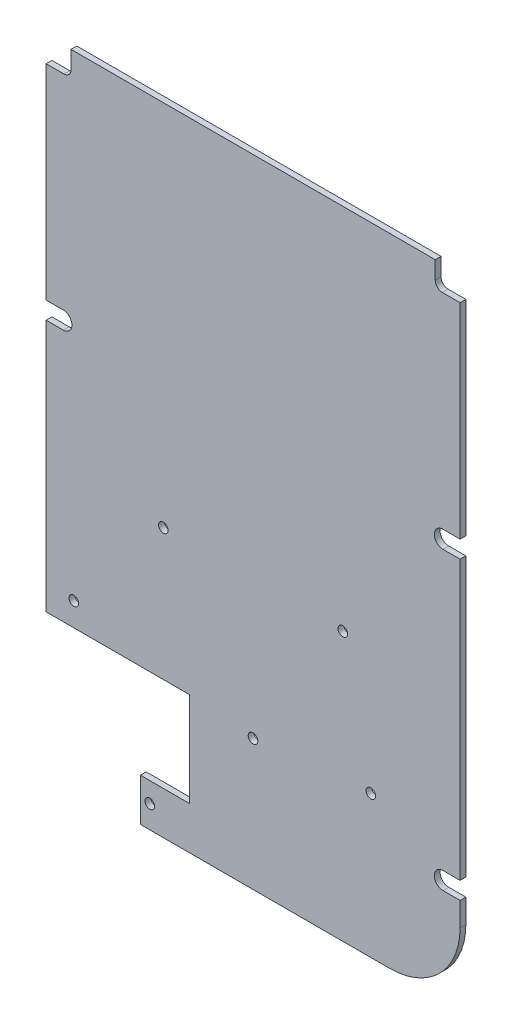
ISO-10303-21;
HEADER;
FILE_DESCRIPTION(('STEP AP214'),'2;1');
FILE_NAME('part.step','',(''),(''),'','','');
FILE_SCHEMA(('AUTOMOTIVE_DESIGN { 1 0 10303 214 1 1 1 1 }'));
ENDSEC;
DATA;
#1=APPLICATION_CONTEXT('core data for automotive mechanical design processes');
#2=APPLICATION_PROTOCOL_DEFINITION('international standard','automotive_design',2000,#1);
#3=PRODUCT_CONTEXT('',#1,'mechanical');
#4=PRODUCT('Part','Part','',(#3));
#5=PRODUCT_RELATED_PRODUCT_CATEGORY('part','',(#4));
#6=PRODUCT_DEFINITION_FORMATION('','',#4);
#7=PRODUCT_DEFINITION_CONTEXT('part definition',#1,'design');
#8=PRODUCT_DEFINITION('design','',#6,#7);
#9=PRODUCT_DEFINITION_SHAPE('','',#8);
#10=(LENGTH_UNIT() NAMED_UNIT(*) SI_UNIT(.MILLI.,.METRE.));
#11=(NAMED_UNIT(*) PLANE_ANGLE_UNIT() SI_UNIT($,.RADIAN.));
#12=(NAMED_UNIT(*) SI_UNIT($,.STERADIAN.) SOLID_ANGLE_UNIT());
#13=UNCERTAINTY_MEASURE_WITH_UNIT(LENGTH_MEASURE(1.E-05),#10,'distance_accuracy_value','');
#14=(GEOMETRIC_REPRESENTATION_CONTEXT(3) GLOBAL_UNCERTAINTY_ASSIGNED_CONTEXT((#13)) GLOBAL_UNIT_ASSIGNED_CONTEXT((#10,
#11,#12)) REPRESENTATION_CONTEXT('',''));
#15=CARTESIAN_POINT('',(0.,0.,0.));
#16=DIRECTION('',(0.,0.,1.));
#17=DIRECTION('',(1.,0.,0.));
#18=AXIS2_PLACEMENT_3D('',#15,#16,#17);
#19=CARTESIAN_POINT('',(-40.475,17.05,1.23));
#20=DIRECTION('',(0.,0.,1.));
#21=DIRECTION('',(1.,0.,0.));
#22=AXIS2_PLACEMENT_3D('',#19,#20,#21);
#23=PLANE('',#22);
#24=DIRECTION('',(0.,1.,0.));
#25=VECTOR('',#24,1.);
#26=CARTESIAN_POINT('',(-38.825,67.85,1.23));
#27=LINE('',#26,#25);
#28=CARTESIAN_POINT('',(-38.825,64.05,1.23));
#29=VERTEX_POINT('',#28);
#30=CARTESIAN_POINT('',(-38.825,67.85,1.23));
#31=VERTEX_POINT('',#30);
#32=EDGE_CURVE('E224',#29,#31,#27,.T.);
#33=ORIENTED_EDGE('',*,*,#32,.F.);
#34=CARTESIAN_POINT('',(-40.325,64.05,1.23));
#35=DIRECTION('',(0.,0.,1.));
#36=DIRECTION('',(1.,0.,0.));
#37=AXIS2_PLACEMENT_3D('',#34,#35,#36);
#38=CIRCLE('',#37,1.5);
#39=CARTESIAN_POINT('',(-40.325,62.55,1.23));
#40=VERTEX_POINT('',#39);
#41=EDGE_CURVE('E47',#29,#40,#38,.F.);
#42=ORIENTED_EDGE('',*,*,#41,.T.);
#43=DIRECTION('',(1.,0.,0.));
#44=VECTOR('',#43,1.);
#45=CARTESIAN_POINT('',(-44.125,62.55,1.23));
#46=LINE('',#45,#44);
#47=CARTESIAN_POINT('',(-44.125,62.55,1.23));
#48=VERTEX_POINT('',#47);
#49=EDGE_CURVE('E217',#48,#40,#46,.T.);
#50=ORIENTED_EDGE('',*,*,#49,.F.);
#51=DIRECTION('',(0.,-1.,0.));
#52=VECTOR('',#51,1.);
#53=CARTESIAN_POINT('',(-44.125,67.85,1.23));
#54=LINE('',#53,#52);
#55=CARTESIAN_POINT('',(-44.125,18.9,1.23));
#56=VERTEX_POINT('',#55);
#57=EDGE_CURVE('E227',#48,#56,#54,.T.);
#58=ORIENTED_EDGE('',*,*,#57,.T.);
#59=DIRECTION('',(1.,0.,0.));
#60=VECTOR('',#59,1.);
#61=CARTESIAN_POINT('',(-40.475,18.9,1.23));
#62=LINE('',#61,#60);
#63=CARTESIAN_POINT('',(-40.475,18.9,1.23));
#64=VERTEX_POINT('',#63);
#65=EDGE_CURVE('E237',#56,#64,#62,.T.);
#66=ORIENTED_EDGE('',*,*,#65,.T.);
#67=CARTESIAN_POINT('',(-40.475,17.05,1.23));
#68=DIRECTION('',(0.,0.,-1.));
#69=DIRECTION('',(1.,0.,0.));
#70=AXIS2_PLACEMENT_3D('',#67,#68,#69);
#71=CIRCLE('',#70,1.85);
#72=CARTESIAN_POINT('',(-40.475,15.2,1.23));
#73=VERTEX_POINT('',#72);
#74=EDGE_CURVE('E242',#64,#73,#71,.T.);
#75=ORIENTED_EDGE('',*,*,#74,.T.);
#76=DIRECTION('',(-1.,0.,0.));
#77=VECTOR('',#76,1.);
#78=CARTESIAN_POINT('',(-40.475,15.2,1.23));
#79=LINE('',#78,#77);
#80=CARTESIAN_POINT('',(-44.125,15.2,1.23));
#81=VERTEX_POINT('',#80);
#82=EDGE_CURVE('E253',#73,#81,#79,.T.);
#83=ORIENTED_EDGE('',*,*,#82,.T.);
#84=DIRECTION('',(0.,-1.,0.));
#85=VECTOR('',#84,1.);
#86=CARTESIAN_POINT('',(-44.125,15.2,1.23));
#87=LINE('',#86,#85);
#88=CARTESIAN_POINT('',(-44.125,-38.65,1.23));
#89=VERTEX_POINT('',#88);
#90=EDGE_CURVE('E256',#81,#89,#87,.T.);
#91=ORIENTED_EDGE('',*,*,#90,.T.);
#92=DIRECTION('',(1.,0.,0.));
#93=VECTOR('',#92,1.);
#94=CARTESIAN_POINT('',(-44.125,-38.65,1.23));
#95=LINE('',#94,#93);
#96=CARTESIAN_POINT('',(-13.525,-38.65,1.23));
#97=VERTEX_POINT('',#96);
#98=EDGE_CURVE('E259',#89,#97,#95,.T.);
#99=ORIENTED_EDGE('',*,*,#98,.T.);
#100=DIRECTION('',(0.,-1.,0.));
#101=VECTOR('',#100,1.);
#102=CARTESIAN_POINT('',(-13.525,-38.65,1.23));
#103=LINE('',#102,#101);
#104=CARTESIAN_POINT('',(-13.525,-58.75,1.23));
#105=VERTEX_POINT('',#104);
#106=EDGE_CURVE('E262',#97,#105,#103,.T.);
#107=ORIENTED_EDGE('',*,*,#106,.T.);
#108=DIRECTION('',(-1.,0.,0.));
#109=VECTOR('',#108,1.);
#110=CARTESIAN_POINT('',(-24.025,-58.75,1.23));
#111=LINE('',#110,#109);
#112=CARTESIAN_POINT('',(-24.025,-58.75,1.23));
#113=VERTEX_POINT('',#112);
#114=EDGE_CURVE('E265',#105,#113,#111,.T.);
#115=ORIENTED_EDGE('',*,*,#114,.T.);
#116=DIRECTION('',(0.,-1.,0.));
#117=VECTOR('',#116,1.);
#118=CARTESIAN_POINT('',(-24.025,-58.75,1.23));
#119=LINE('',#118,#117);
#120=CARTESIAN_POINT('',(-24.025,-67.85,1.23));
#121=VERTEX_POINT('',#120);
#122=EDGE_CURVE('E268',#113,#121,#119,.T.);
#123=ORIENTED_EDGE('',*,*,#122,.T.);
#124=DIRECTION('',(1.,0.,0.));
#125=VECTOR('',#124,1.);
#126=CARTESIAN_POINT('',(-24.025,-67.85,1.23));
#127=LINE('',#126,#125);
#128=CARTESIAN_POINT('',(29.1249999999999,-67.85,1.23));
#129=VERTEX_POINT('',#128);
#130=EDGE_CURVE('E271',#121,#129,#127,.T.);
#131=ORIENTED_EDGE('',*,*,#130,.T.);
#132=CARTESIAN_POINT('',(29.125,-52.85,1.23));
#133=DIRECTION('',(0.,0.,1.));
#134=DIRECTION('',(1.,0.,0.));
#135=AXIS2_PLACEMENT_3D('',#132,#133,#134);
#136=CIRCLE('',#135,15.);
#137=CARTESIAN_POINT('',(44.125,-52.85,1.23));
#138=VERTEX_POINT('',#137);
#139=EDGE_CURVE('E274',#129,#138,#136,.T.);
#140=ORIENTED_EDGE('',*,*,#139,.T.);
#141=DIRECTION('',(0.,1.,0.));
#142=VECTOR('',#141,1.);
#143=CARTESIAN_POINT('',(44.125,-47.8,1.23));
#144=LINE('',#143,#142);
#145=CARTESIAN_POINT('',(44.125,-47.8,1.23));
#146=VERTEX_POINT('',#145);
#147=EDGE_CURVE('E277',#138,#146,#144,.T.);
#148=ORIENTED_EDGE('',*,*,#147,.T.);
#149=DIRECTION('',(-1.,0.,0.));
#150=VECTOR('',#149,1.);
#151=CARTESIAN_POINT('',(40.475,-47.8,1.23));
#152=LINE('',#151,#150);
#153=CARTESIAN_POINT('',(40.475,-47.8,1.23));
#154=VERTEX_POINT('',#153);
#155=EDGE_CURVE('E280',#146,#154,#152,.T.);
#156=ORIENTED_EDGE('',*,*,#155,.T.);
#157=CARTESIAN_POINT('',(40.475,-45.95,1.23));
#158=DIRECTION('',(0.,0.,-1.));
#159=DIRECTION('',(1.,0.,0.));
#160=AXIS2_PLACEMENT_3D('',#157,#158,#159);
#161=CIRCLE('',#160,1.84999999999999);
#162=CARTESIAN_POINT('',(40.475,-44.1,1.23));
#163=VERTEX_POINT('',#162);
#164=EDGE_CURVE('E283',#154,#163,#161,.T.);
#165=ORIENTED_EDGE('',*,*,#164,.T.);
#166=DIRECTION('',(1.,0.,0.));
#167=VECTOR('',#166,1.);
#168=CARTESIAN_POINT('',(40.475,-44.1,1.23));
#169=LINE('',#168,#167);
#170=CARTESIAN_POINT('',(44.125,-44.1,1.23));
#171=VERTEX_POINT('',#170);
#172=EDGE_CURVE('E286',#163,#171,#169,.T.);
#173=ORIENTED_EDGE('',*,*,#172,.T.);
#174=DIRECTION('',(0.,1.,0.));
#175=VECTOR('',#174,1.);
#176=CARTESIAN_POINT('',(44.125,15.2,1.23));
#177=LINE('',#176,#175);
#178=CARTESIAN_POINT('',(44.125,15.2,1.23));
#179=VERTEX_POINT('',#178);
#180=EDGE_CURVE('E289',#171,#179,#177,.T.);
#181=ORIENTED_EDGE('',*,*,#180,.T.);
#182=DIRECTION('',(-1.,0.,0.));
#183=VECTOR('',#182,1.);
#184=CARTESIAN_POINT('',(40.475,15.2,1.23));
#185=LINE('',#184,#183);
#186=CARTESIAN_POINT('',(40.475,15.2000000000002,1.23));
#187=VERTEX_POINT('',#186);
#188=EDGE_CURVE('E292',#179,#187,#185,.T.);
#189=ORIENTED_EDGE('',*,*,#188,.T.);
#190=CARTESIAN_POINT('',(40.475,17.0500000000002,1.23));
#191=DIRECTION('',(0.,0.,-1.));
#192=DIRECTION('',(1.,0.,0.));
#193=AXIS2_PLACEMENT_3D('',#190,#191,#192);
#194=CIRCLE('',#193,1.85);
#195=CARTESIAN_POINT('',(40.475,18.9,1.23));
#196=VERTEX_POINT('',#195);
#197=EDGE_CURVE('E295',#187,#196,#194,.T.);
#198=ORIENTED_EDGE('',*,*,#197,.T.);
#199=DIRECTION('',(1.,0.,0.));
#200=VECTOR('',#199,1.);
#201=CARTESIAN_POINT('',(40.475,18.9,1.23));
#202=LINE('',#201,#200);
#203=CARTESIAN_POINT('',(44.125,18.9,1.23));
#204=VERTEX_POINT('',#203);
#205=EDGE_CURVE('E298',#196,#204,#202,.T.);
#206=ORIENTED_EDGE('',*,*,#205,.T.);
#207=DIRECTION('',(0.,1.,0.));
#208=VECTOR('',#207,1.);
#209=CARTESIAN_POINT('',(44.125,67.85,1.23));
#210=LINE('',#209,#208);
#211=CARTESIAN_POINT('',(44.125,62.55,1.23));
#212=VERTEX_POINT('',#211);
#213=EDGE_CURVE('E301',#204,#212,#210,.T.);
#214=ORIENTED_EDGE('',*,*,#213,.T.);
#215=DIRECTION('',(1.,0.,0.));
#216=VECTOR('',#215,1.);
#217=CARTESIAN_POINT('',(44.125,62.55,1.23));
#218=LINE('',#217,#216);
#219=CARTESIAN_POINT('',(40.325,62.55,1.23));
#220=VERTEX_POINT('',#219);
#221=EDGE_CURVE('E496',#220,#212,#218,.T.);
#222=ORIENTED_EDGE('',*,*,#221,.F.);
#223=CARTESIAN_POINT('',(40.325,64.05,1.23));
#224=DIRECTION('',(0.,0.,1.));
#225=DIRECTION('',(1.,0.,0.));
#226=AXIS2_PLACEMENT_3D('',#223,#224,#225);
#227=CIRCLE('',#226,1.5);
#228=CARTESIAN_POINT('',(38.825,64.05,1.23));
#229=VERTEX_POINT('',#228);
#230=EDGE_CURVE('E465',#220,#229,#227,.F.);
#231=ORIENTED_EDGE('',*,*,#230,.T.);
#232=DIRECTION('',(0.,-1.,0.));
#233=VECTOR('',#232,1.);
#234=CARTESIAN_POINT('',(38.825,67.85,1.23));
#235=LINE('',#234,#233);
#236=CARTESIAN_POINT('',(38.825,67.85,1.23));
#237=VERTEX_POINT('',#236);
#238=EDGE_CURVE('E494',#237,#229,#235,.T.);
#239=ORIENTED_EDGE('',*,*,#238,.F.);
#240=DIRECTION('',(-1.,0.,0.));
#241=VECTOR('',#240,1.);
#242=CARTESIAN_POINT('',(-44.125,67.85,1.23));
#243=LINE('',#242,#241);
#244=EDGE_CURVE('E305',#237,#31,#243,.T.);
#245=ORIENTED_EDGE('',*,*,#244,.T.);
#246=EDGE_LOOP('',(#33,#42,#50,#58,#66,#75,#83,#91,#99,#107,#115,#123,#131,#140,#148,#156,#165,
#173,#181,#189,#198,#206,#214,#222,#231,#239,#245));
#247=FACE_BOUND('',#246,.T.);
#248=CARTESIAN_POINT('',(25.075,-37.55,1.23));
#249=DIRECTION('',(0.,0.,1.));
#250=DIRECTION('',(1.,0.,0.));
#251=AXIS2_PLACEMENT_3D('',#248,#249,#250);
#252=CIRCLE('',#251,1.02499999999999);
#253=CARTESIAN_POINT('',(26.1,-37.55,1.23));
#254=VERTEX_POINT('',#253);
#255=EDGE_CURVE('E522',#254,#254,#252,.T.);
#256=ORIENTED_EDGE('',*,*,#255,.F.);
#257=EDGE_LOOP('',(#256));
#258=FACE_BOUND('',#257,.T.);
#259=CARTESIAN_POINT('',(-0.0249999999999971,-39.95,1.23));
#260=DIRECTION('',(0.,0.,1.));
#261=DIRECTION('',(1.,0.,0.));
#262=AXIS2_PLACEMENT_3D('',#259,#260,#261);
#263=CIRCLE('',#262,1.025);
#264=CARTESIAN_POINT('',(1.,-39.95,1.23));
#265=VERTEX_POINT('',#264);
#266=EDGE_CURVE('E538',#265,#265,#263,.T.);
#267=ORIENTED_EDGE('',*,*,#266,.F.);
#268=EDGE_LOOP('',(#267));
#269=FACE_BOUND('',#268,.T.);
#270=CARTESIAN_POINT('',(-22.025,-63.,1.23));
#271=DIRECTION('',(0.,0.,1.));
#272=DIRECTION('',(1.,0.,0.));
#273=AXIS2_PLACEMENT_3D('',#270,#271,#272);
#274=CIRCLE('',#273,1.025);
#275=CARTESIAN_POINT('',(-21.,-63.,1.23));
#276=VERTEX_POINT('',#275);
#277=EDGE_CURVE('E314',#276,#276,#274,.T.);
#278=ORIENTED_EDGE('',*,*,#277,.F.);
#279=EDGE_LOOP('',(#278));
#280=FACE_BOUND('',#279,.T.);
#281=CARTESIAN_POINT('',(-19.125,-10.6,1.23));
#282=DIRECTION('',(0.,0.,1.));
#283=DIRECTION('',(1.,0.,0.));
#284=AXIS2_PLACEMENT_3D('',#281,#282,#283);
#285=CIRCLE('',#284,1.025);
#286=CARTESIAN_POINT('',(-18.1,-10.6,1.23));
#287=VERTEX_POINT('',#286);
#288=EDGE_CURVE('E546',#287,#287,#285,.T.);
#289=ORIENTED_EDGE('',*,*,#288,.F.);
#290=EDGE_LOOP('',(#289));
#291=FACE_BOUND('',#290,.T.);
#292=CARTESIAN_POINT('',(-38.225,-33.65,1.23));
#293=DIRECTION('',(0.,0.,1.));
#294=DIRECTION('',(1.,0.,0.));
#295=AXIS2_PLACEMENT_3D('',#292,#293,#294);
#296=CIRCLE('',#295,1.025);
#297=CARTESIAN_POINT('',(-37.2,-33.65,1.23));
#298=VERTEX_POINT('',#297);
#299=EDGE_CURVE('E530',#298,#298,#296,.T.);
#300=ORIENTED_EDGE('',*,*,#299,.F.);
#301=EDGE_LOOP('',(#300));
#302=FACE_BOUND('',#301,.T.);
#303=CARTESIAN_POINT('',(19.125,-10.6,1.23));
#304=DIRECTION('',(0.,0.,1.));
#305=DIRECTION('',(1.,0.,0.));
#306=AXIS2_PLACEMENT_3D('',#303,#304,#305);
#307=CIRCLE('',#306,1.025);
#308=CARTESIAN_POINT('',(20.15,-10.6,1.23));
#309=VERTEX_POINT('',#308);
#310=EDGE_CURVE('E514',#309,#309,#307,.T.);
#311=ORIENTED_EDGE('',*,*,#310,.F.);
#312=EDGE_LOOP('',(#311));
#313=FACE_BOUND('',#312,.T.);
#314=ADVANCED_FACE('F38',(#247,#258,#269,#280,#291,#302,#313),#23,.T.);
#315=CARTESIAN_POINT('',(-40.475,17.05,0.));
#316=DIRECTION('',(0.,0.,1.));
#317=DIRECTION('',(1.,0.,0.));
#318=AXIS2_PLACEMENT_3D('',#315,#316,#317);
#319=PLANE('',#318);
#320=DIRECTION('',(1.,0.,0.));
#321=VECTOR('',#320,1.);
#322=CARTESIAN_POINT('',(-40.475,62.55,0.));
#323=LINE('',#322,#321);
#324=CARTESIAN_POINT('',(-44.125,62.55,0.));
#325=VERTEX_POINT('',#324);
#326=CARTESIAN_POINT('',(-40.325,62.55,0.));
#327=VERTEX_POINT('',#326);
#328=EDGE_CURVE('E218',#325,#327,#323,.T.);
#329=ORIENTED_EDGE('',*,*,#328,.T.);
#330=CARTESIAN_POINT('',(-40.325,64.05,0.));
#331=DIRECTION('',(0.,0.,1.));
#332=DIRECTION('',(1.,0.,0.));
#333=AXIS2_PLACEMENT_3D('',#330,#331,#332);
#334=CIRCLE('',#333,1.5);
#335=CARTESIAN_POINT('',(-38.825,64.05,0.));
#336=VERTEX_POINT('',#335);
#337=EDGE_CURVE('E11',#327,#336,#334,.T.);
#338=ORIENTED_EDGE('',*,*,#337,.T.);
#339=DIRECTION('',(0.,1.,0.));
#340=VECTOR('',#339,1.);
#341=CARTESIAN_POINT('',(-38.825,17.05,0.));
#342=LINE('',#341,#340);
#343=CARTESIAN_POINT('',(-38.825,67.85,0.));
#344=VERTEX_POINT('',#343);
#345=EDGE_CURVE('E489',#336,#344,#342,.T.);
#346=ORIENTED_EDGE('',*,*,#345,.T.);
#347=DIRECTION('',(-1.,0.,0.));
#348=VECTOR('',#347,1.);
#349=CARTESIAN_POINT('',(-44.125,67.85,0.));
#350=LINE('',#349,#348);
#351=CARTESIAN_POINT('',(38.825,67.85,0.));
#352=VERTEX_POINT('',#351);
#353=EDGE_CURVE('E238',#352,#344,#350,.T.);
#354=ORIENTED_EDGE('',*,*,#353,.F.);
#355=DIRECTION('',(0.,-1.,0.));
#356=VECTOR('',#355,1.);
#357=CARTESIAN_POINT('',(38.825,17.05,0.));
#358=LINE('',#357,#356);
#359=CARTESIAN_POINT('',(38.825,64.05,0.));
#360=VERTEX_POINT('',#359);
#361=EDGE_CURVE('E223',#352,#360,#358,.T.);
#362=ORIENTED_EDGE('',*,*,#361,.T.);
#363=CARTESIAN_POINT('',(40.325,64.05,0.));
#364=DIRECTION('',(0.,0.,1.));
#365=DIRECTION('',(1.,0.,0.));
#366=AXIS2_PLACEMENT_3D('',#363,#364,#365);
#367=CIRCLE('',#366,1.5);
#368=CARTESIAN_POINT('',(40.325,62.55,0.));
#369=VERTEX_POINT('',#368);
#370=EDGE_CURVE('E468',#360,#369,#367,.T.);
#371=ORIENTED_EDGE('',*,*,#370,.T.);
#372=DIRECTION('',(1.,0.,0.));
#373=VECTOR('',#372,1.);
#374=CARTESIAN_POINT('',(-40.475,62.55,0.));
#375=LINE('',#374,#373);
#376=CARTESIAN_POINT('',(44.125,62.55,0.));
#377=VERTEX_POINT('',#376);
#378=EDGE_CURVE('E478',#369,#377,#375,.T.);
#379=ORIENTED_EDGE('',*,*,#378,.T.);
#380=DIRECTION('',(0.,1.,0.));
#381=VECTOR('',#380,1.);
#382=CARTESIAN_POINT('',(44.125,67.85,0.));
#383=LINE('',#382,#381);
#384=CARTESIAN_POINT('',(44.125,18.9,0.));
#385=VERTEX_POINT('',#384);
#386=EDGE_CURVE('E245',#385,#377,#383,.T.);
#387=ORIENTED_EDGE('',*,*,#386,.F.);
#388=DIRECTION('',(1.,0.,0.));
#389=VECTOR('',#388,1.);
#390=CARTESIAN_POINT('',(40.475,18.9,0.));
#391=LINE('',#390,#389);
#392=CARTESIAN_POINT('',(40.475,18.9,0.));
#393=VERTEX_POINT('',#392);
#394=EDGE_CURVE('E365',#393,#385,#391,.T.);
#395=ORIENTED_EDGE('',*,*,#394,.F.);
#396=CARTESIAN_POINT('',(40.475,17.0500000000002,0.));
#397=DIRECTION('',(0.,0.,-1.));
#398=DIRECTION('',(1.,0.,0.));
#399=AXIS2_PLACEMENT_3D('',#396,#397,#398);
#400=CIRCLE('',#399,1.85);
#401=CARTESIAN_POINT('',(40.475,15.2000000000002,0.));
#402=VERTEX_POINT('',#401);
#403=EDGE_CURVE('E362',#402,#393,#400,.T.);
#404=ORIENTED_EDGE('',*,*,#403,.F.);
#405=DIRECTION('',(-1.,0.,0.));
#406=VECTOR('',#405,1.);
#407=CARTESIAN_POINT('',(40.475,15.2,0.));
#408=LINE('',#407,#406);
#409=CARTESIAN_POINT('',(44.125,15.2,0.));
#410=VERTEX_POINT('',#409);
#411=EDGE_CURVE('E359',#410,#402,#408,.T.);
#412=ORIENTED_EDGE('',*,*,#411,.F.);
#413=DIRECTION('',(0.,1.,0.));
#414=VECTOR('',#413,1.);
#415=CARTESIAN_POINT('',(44.125,15.2,0.));
#416=LINE('',#415,#414);
#417=CARTESIAN_POINT('',(44.125,-44.1,0.));
#418=VERTEX_POINT('',#417);
#419=EDGE_CURVE('E356',#418,#410,#416,.T.);
#420=ORIENTED_EDGE('',*,*,#419,.F.);
#421=DIRECTION('',(1.,0.,0.));
#422=VECTOR('',#421,1.);
#423=CARTESIAN_POINT('',(40.475,-44.1,0.));
#424=LINE('',#423,#422);
#425=CARTESIAN_POINT('',(40.475,-44.1,0.));
#426=VERTEX_POINT('',#425);
#427=EDGE_CURVE('E353',#426,#418,#424,.T.);
#428=ORIENTED_EDGE('',*,*,#427,.F.);
#429=CARTESIAN_POINT('',(40.475,-45.95,0.));
#430=DIRECTION('',(0.,0.,-1.));
#431=DIRECTION('',(1.,0.,0.));
#432=AXIS2_PLACEMENT_3D('',#429,#430,#431);
#433=CIRCLE('',#432,1.84999999999999);
#434=CARTESIAN_POINT('',(40.475,-47.8,0.));
#435=VERTEX_POINT('',#434);
#436=EDGE_CURVE('E350',#435,#426,#433,.T.);
#437=ORIENTED_EDGE('',*,*,#436,.F.);
#438=DIRECTION('',(-1.,0.,0.));
#439=VECTOR('',#438,1.);
#440=CARTESIAN_POINT('',(40.475,-47.8,0.));
#441=LINE('',#440,#439);
#442=CARTESIAN_POINT('',(44.125,-47.8,0.));
#443=VERTEX_POINT('',#442);
#444=EDGE_CURVE('E347',#443,#435,#441,.T.);
#445=ORIENTED_EDGE('',*,*,#444,.F.);
#446=DIRECTION('',(0.,1.,0.));
#447=VECTOR('',#446,1.);
#448=CARTESIAN_POINT('',(44.125,-47.8,0.));
#449=LINE('',#448,#447);
#450=CARTESIAN_POINT('',(44.125,-52.85,0.));
#451=VERTEX_POINT('',#450);
#452=EDGE_CURVE('E344',#451,#443,#449,.T.);
#453=ORIENTED_EDGE('',*,*,#452,.F.);
#454=CARTESIAN_POINT('',(29.125,-52.85,0.));
#455=DIRECTION('',(0.,0.,1.));
#456=DIRECTION('',(1.,0.,0.));
#457=AXIS2_PLACEMENT_3D('',#454,#455,#456);
#458=CIRCLE('',#457,15.);
#459=CARTESIAN_POINT('',(29.1249999999999,-67.85,0.));
#460=VERTEX_POINT('',#459);
#461=EDGE_CURVE('E341',#460,#451,#458,.T.);
#462=ORIENTED_EDGE('',*,*,#461,.F.);
#463=DIRECTION('',(1.,0.,0.));
#464=VECTOR('',#463,1.);
#465=CARTESIAN_POINT('',(-24.025,-67.85,0.));
#466=LINE('',#465,#464);
#467=CARTESIAN_POINT('',(-24.025,-67.85,0.));
#468=VERTEX_POINT('',#467);
#469=EDGE_CURVE('E338',#468,#460,#466,.T.);
#470=ORIENTED_EDGE('',*,*,#469,.F.);
#471=DIRECTION('',(0.,-1.,0.));
#472=VECTOR('',#471,1.);
#473=CARTESIAN_POINT('',(-24.025,-58.75,0.));
#474=LINE('',#473,#472);
#475=CARTESIAN_POINT('',(-24.025,-58.75,0.));
#476=VERTEX_POINT('',#475);
#477=EDGE_CURVE('E335',#476,#468,#474,.T.);
#478=ORIENTED_EDGE('',*,*,#477,.F.);
#479=DIRECTION('',(-1.,0.,0.));
#480=VECTOR('',#479,1.);
#481=CARTESIAN_POINT('',(-24.025,-58.75,0.));
#482=LINE('',#481,#480);
#483=CARTESIAN_POINT('',(-13.525,-58.75,0.));
#484=VERTEX_POINT('',#483);
#485=EDGE_CURVE('E332',#484,#476,#482,.T.);
#486=ORIENTED_EDGE('',*,*,#485,.F.);
#487=DIRECTION('',(0.,-1.,0.));
#488=VECTOR('',#487,1.);
#489=CARTESIAN_POINT('',(-13.525,-38.65,0.));
#490=LINE('',#489,#488);
#491=CARTESIAN_POINT('',(-13.525,-38.65,0.));
#492=VERTEX_POINT('',#491);
#493=EDGE_CURVE('E329',#492,#484,#490,.T.);
#494=ORIENTED_EDGE('',*,*,#493,.F.);
#495=DIRECTION('',(1.,0.,0.));
#496=VECTOR('',#495,1.);
#497=CARTESIAN_POINT('',(-44.125,-38.65,0.));
#498=LINE('',#497,#496);
#499=CARTESIAN_POINT('',(-44.125,-38.65,0.));
#500=VERTEX_POINT('',#499);
#501=EDGE_CURVE('E326',#500,#492,#498,.T.);
#502=ORIENTED_EDGE('',*,*,#501,.F.);
#503=DIRECTION('',(0.,-1.,0.));
#504=VECTOR('',#503,1.);
#505=CARTESIAN_POINT('',(-44.125,15.2,0.));
#506=LINE('',#505,#504);
#507=CARTESIAN_POINT('',(-44.125,15.2,0.));
#508=VERTEX_POINT('',#507);
#509=EDGE_CURVE('E323',#508,#500,#506,.T.);
#510=ORIENTED_EDGE('',*,*,#509,.F.);
#511=DIRECTION('',(-1.,0.,0.));
#512=VECTOR('',#511,1.);
#513=CARTESIAN_POINT('',(-40.475,15.2,0.));
#514=LINE('',#513,#512);
#515=CARTESIAN_POINT('',(-40.475,15.2,0.));
#516=VERTEX_POINT('',#515);
#517=EDGE_CURVE('E320',#516,#508,#514,.T.);
#518=ORIENTED_EDGE('',*,*,#517,.F.);
#519=CARTESIAN_POINT('',(-40.475,17.05,0.));
#520=DIRECTION('',(0.,0.,-1.));
#521=DIRECTION('',(1.,0.,0.));
#522=AXIS2_PLACEMENT_3D('',#519,#520,#521);
#523=CIRCLE('',#522,1.85);
#524=CARTESIAN_POINT('',(-40.475,18.9,0.));
#525=VERTEX_POINT('',#524);
#526=EDGE_CURVE('E317',#525,#516,#523,.T.);
#527=ORIENTED_EDGE('',*,*,#526,.F.);
#528=DIRECTION('',(1.,0.,0.));
#529=VECTOR('',#528,1.);
#530=CARTESIAN_POINT('',(-40.475,18.9,0.));
#531=LINE('',#530,#529);
#532=CARTESIAN_POINT('',(-44.125,18.9,0.));
#533=VERTEX_POINT('',#532);
#534=EDGE_CURVE('E313',#533,#525,#531,.T.);
#535=ORIENTED_EDGE('',*,*,#534,.F.);
#536=DIRECTION('',(0.,-1.,0.));
#537=VECTOR('',#536,1.);
#538=CARTESIAN_POINT('',(-44.125,67.85,0.));
#539=LINE('',#538,#537);
#540=EDGE_CURVE('E310',#325,#533,#539,.T.);
#541=ORIENTED_EDGE('',*,*,#540,.F.);
#542=EDGE_LOOP('',(#329,#338,#346,#354,#362,#371,#379,#387,#395,#404,#412,#420,#428,#437,#445,
#453,#462,#470,#478,#486,#494,#502,#510,#518,#527,#535,#541));
#543=FACE_BOUND('',#542,.T.);
#544=CARTESIAN_POINT('',(-22.025,-63.,0.));
#545=DIRECTION('',(0.,0.,1.));
#546=DIRECTION('',(1.,0.,0.));
#547=AXIS2_PLACEMENT_3D('',#544,#545,#546);
#548=CIRCLE('',#547,1.025);
#549=CARTESIAN_POINT('',(-21.,-63.,0.));
#550=VERTEX_POINT('',#549);
#551=EDGE_CURVE('E248',#550,#550,#548,.T.);
#552=ORIENTED_EDGE('',*,*,#551,.T.);
#553=EDGE_LOOP('',(#552));
#554=FACE_BOUND('',#553,.T.);
#555=CARTESIAN_POINT('',(-19.125,-10.6,0.));
#556=DIRECTION('',(0.,0.,1.));
#557=DIRECTION('',(1.,0.,0.));
#558=AXIS2_PLACEMENT_3D('',#555,#556,#557);
#559=CIRCLE('',#558,1.025);
#560=CARTESIAN_POINT('',(-18.1,-10.6,0.));
#561=VERTEX_POINT('',#560);
#562=EDGE_CURVE('E542',#561,#561,#559,.T.);
#563=ORIENTED_EDGE('',*,*,#562,.T.);
#564=EDGE_LOOP('',(#563));
#565=FACE_BOUND('',#564,.T.);
#566=CARTESIAN_POINT('',(-0.0249999999999971,-39.95,0.));
#567=DIRECTION('',(0.,0.,1.));
#568=DIRECTION('',(1.,0.,0.));
#569=AXIS2_PLACEMENT_3D('',#566,#567,#568);
#570=CIRCLE('',#569,1.025);
#571=CARTESIAN_POINT('',(1.,-39.95,0.));
#572=VERTEX_POINT('',#571);
#573=EDGE_CURVE('E534',#572,#572,#570,.T.);
#574=ORIENTED_EDGE('',*,*,#573,.T.);
#575=EDGE_LOOP('',(#574));
#576=FACE_BOUND('',#575,.T.);
#577=CARTESIAN_POINT('',(-38.225,-33.65,0.));
#578=DIRECTION('',(0.,0.,1.));
#579=DIRECTION('',(1.,0.,0.));
#580=AXIS2_PLACEMENT_3D('',#577,#578,#579);
#581=CIRCLE('',#580,1.025);
#582=CARTESIAN_POINT('',(-37.2,-33.65,0.));
#583=VERTEX_POINT('',#582);
#584=EDGE_CURVE('E526',#583,#583,#581,.T.);
#585=ORIENTED_EDGE('',*,*,#584,.T.);
#586=EDGE_LOOP('',(#585));
#587=FACE_BOUND('',#586,.T.);
#588=CARTESIAN_POINT('',(25.075,-37.55,0.));
#589=DIRECTION('',(0.,0.,1.));
#590=DIRECTION('',(1.,0.,0.));
#591=AXIS2_PLACEMENT_3D('',#588,#589,#590);
#592=CIRCLE('',#591,1.02499999999999);
#593=CARTESIAN_POINT('',(26.1,-37.55,0.));
#594=VERTEX_POINT('',#593);
#595=EDGE_CURVE('E518',#594,#594,#592,.T.);
#596=ORIENTED_EDGE('',*,*,#595,.T.);
#597=EDGE_LOOP('',(#596));
#598=FACE_BOUND('',#597,.T.);
#599=CARTESIAN_POINT('',(19.125,-10.6,0.));
#600=DIRECTION('',(0.,0.,1.));
#601=DIRECTION('',(1.,0.,0.));
#602=AXIS2_PLACEMENT_3D('',#599,#600,#601);
#603=CIRCLE('',#602,1.025);
#604=CARTESIAN_POINT('',(20.15,-10.6,0.));
#605=VERTEX_POINT('',#604);
#606=EDGE_CURVE('E513',#605,#605,#603,.T.);
#607=ORIENTED_EDGE('',*,*,#606,.T.);
#608=EDGE_LOOP('',(#607));
#609=FACE_BOUND('',#608,.T.);
#610=ADVANCED_FACE('F475',(#543,#554,#565,#576,#587,#598,#609),#319,.F.);
#611=CARTESIAN_POINT('',(-44.125,67.85,1.23));
#612=DIRECTION('',(1.,0.,0.));
#613=DIRECTION('',(0.,0.,-1.));
#614=AXIS2_PLACEMENT_3D('',#611,#612,#613);
#615=PLANE('',#614);
#616=ORIENTED_EDGE('',*,*,#57,.F.);
#617=DIRECTION('',(0.,0.,1.));
#618=VECTOR('',#617,1.);
#619=CARTESIAN_POINT('',(-44.125,62.55,-8.77));
#620=LINE('',#619,#618);
#621=EDGE_CURVE('E215',#325,#48,#620,.T.);
#622=ORIENTED_EDGE('',*,*,#621,.F.);
#623=ORIENTED_EDGE('',*,*,#540,.T.);
#624=DIRECTION('',(0.,0.,-1.));
#625=VECTOR('',#624,1.);
#626=CARTESIAN_POINT('',(-44.125,18.9,1.23));
#627=LINE('',#626,#625);
#628=EDGE_CURVE('E235',#56,#533,#627,.T.);
#629=ORIENTED_EDGE('',*,*,#628,.F.);
#630=EDGE_LOOP('',(#616,#622,#623,#629));
#631=FACE_BOUND('',#630,.T.);
#632=ADVANCED_FACE('F233',(#631),#615,.F.);
#633=CARTESIAN_POINT('',(-40.475,18.9,1.23));
#634=DIRECTION('',(0.,1.,0.));
#635=DIRECTION('',(0.,0.,1.));
#636=AXIS2_PLACEMENT_3D('',#633,#634,#635);
#637=PLANE('',#636);
#638=ORIENTED_EDGE('',*,*,#534,.T.);
#639=DIRECTION('',(0.,0.,-1.));
#640=VECTOR('',#639,1.);
#641=CARTESIAN_POINT('',(-40.475,18.9,1.23));
#642=LINE('',#641,#640);
#643=EDGE_CURVE('E438',#64,#525,#642,.T.);
#644=ORIENTED_EDGE('',*,*,#643,.F.);
#645=ORIENTED_EDGE('',*,*,#65,.F.);
#646=ORIENTED_EDGE('',*,*,#628,.T.);
#647=EDGE_LOOP('',(#638,#644,#645,#646));
#648=FACE_BOUND('',#647,.T.);
#649=ADVANCED_FACE('F654',(#648),#637,.F.);
#650=CARTESIAN_POINT('',(-40.475,17.05,1.23));
#651=DIRECTION('',(0.,0.,-1.));
#652=DIRECTION('',(-1.,0.,0.));
#653=AXIS2_PLACEMENT_3D('',#650,#651,#652);
#654=CYLINDRICAL_SURFACE('',#653,1.85);
#655=ORIENTED_EDGE('',*,*,#526,.T.);
#656=DIRECTION('',(0.,0.,-1.));
#657=VECTOR('',#656,1.);
#658=CARTESIAN_POINT('',(-40.475,15.2,1.23));
#659=LINE('',#658,#657);
#660=EDGE_CURVE('E434',#73,#516,#659,.T.);
#661=ORIENTED_EDGE('',*,*,#660,.F.);
#662=ORIENTED_EDGE('',*,*,#74,.F.);
#663=ORIENTED_EDGE('',*,*,#643,.T.);
#664=EDGE_LOOP('',(#655,#661,#662,#663));
#665=FACE_BOUND('',#664,.T.);
#666=ADVANCED_FACE('F650',(#665),#654,.F.);
#667=CARTESIAN_POINT('',(-40.475,15.2,1.23));
#668=DIRECTION('',(0.,-1.,0.));
#669=DIRECTION('',(0.,0.,-1.));
#670=AXIS2_PLACEMENT_3D('',#667,#668,#669);
#671=PLANE('',#670);
#672=ORIENTED_EDGE('',*,*,#517,.T.);
#673=DIRECTION('',(0.,0.,-1.));
#674=VECTOR('',#673,1.);
#675=CARTESIAN_POINT('',(-44.125,15.2,1.23));
#676=LINE('',#675,#674);
#677=EDGE_CURVE('E430',#81,#508,#676,.T.);
#678=ORIENTED_EDGE('',*,*,#677,.F.);
#679=ORIENTED_EDGE('',*,*,#82,.F.);
#680=ORIENTED_EDGE('',*,*,#660,.T.);
#681=EDGE_LOOP('',(#672,#678,#679,#680));
#682=FACE_BOUND('',#681,.T.);
#683=ADVANCED_FACE('F646',(#682),#671,.F.);
#684=CARTESIAN_POINT('',(-44.125,15.2,1.23));
#685=DIRECTION('',(1.,0.,0.));
#686=DIRECTION('',(0.,1.,0.));
#687=AXIS2_PLACEMENT_3D('',#684,#685,#686);
#688=PLANE('',#687);
#689=ORIENTED_EDGE('',*,*,#509,.T.);
#690=DIRECTION('',(0.,0.,-1.));
#691=VECTOR('',#690,1.);
#692=CARTESIAN_POINT('',(-44.125,-38.65,1.23));
#693=LINE('',#692,#691);
#694=EDGE_CURVE('E426',#89,#500,#693,.T.);
#695=ORIENTED_EDGE('',*,*,#694,.F.);
#696=ORIENTED_EDGE('',*,*,#90,.F.);
#697=ORIENTED_EDGE('',*,*,#677,.T.);
#698=EDGE_LOOP('',(#689,#695,#696,#697));
#699=FACE_BOUND('',#698,.T.);
#700=ADVANCED_FACE('F642',(#699),#688,.F.);
#701=CARTESIAN_POINT('',(-44.125,-38.65,1.23));
#702=DIRECTION('',(0.,1.,0.));
#703=DIRECTION('',(0.,0.,1.));
#704=AXIS2_PLACEMENT_3D('',#701,#702,#703);
#705=PLANE('',#704);
#706=ORIENTED_EDGE('',*,*,#501,.T.);
#707=DIRECTION('',(0.,0.,-1.));
#708=VECTOR('',#707,1.);
#709=CARTESIAN_POINT('',(-13.525,-38.65,1.23));
#710=LINE('',#709,#708);
#711=EDGE_CURVE('E422',#97,#492,#710,.T.);
#712=ORIENTED_EDGE('',*,*,#711,.F.);
#713=ORIENTED_EDGE('',*,*,#98,.F.);
#714=ORIENTED_EDGE('',*,*,#694,.T.);
#715=EDGE_LOOP('',(#706,#712,#713,#714));
#716=FACE_BOUND('',#715,.T.);
#717=ADVANCED_FACE('F638',(#716),#705,.F.);
#718=CARTESIAN_POINT('',(-13.525,-38.65,1.23));
#719=DIRECTION('',(1.,0.,0.));
#720=DIRECTION('',(0.,1.,0.));
#721=AXIS2_PLACEMENT_3D('',#718,#719,#720);
#722=PLANE('',#721);
#723=ORIENTED_EDGE('',*,*,#493,.T.);
#724=DIRECTION('',(0.,0.,-1.));
#725=VECTOR('',#724,1.);
#726=CARTESIAN_POINT('',(-13.525,-58.75,1.23));
#727=LINE('',#726,#725);
#728=EDGE_CURVE('E418',#105,#484,#727,.T.);
#729=ORIENTED_EDGE('',*,*,#728,.F.);
#730=ORIENTED_EDGE('',*,*,#106,.F.);
#731=ORIENTED_EDGE('',*,*,#711,.T.);
#732=EDGE_LOOP('',(#723,#729,#730,#731));
#733=FACE_BOUND('',#732,.T.);
#734=ADVANCED_FACE('F634',(#733),#722,.F.);
#735=CARTESIAN_POINT('',(-24.025,-58.75,1.23));
#736=DIRECTION('',(0.,-1.,0.));
#737=DIRECTION('',(0.,0.,-1.));
#738=AXIS2_PLACEMENT_3D('',#735,#736,#737);
#739=PLANE('',#738);
#740=ORIENTED_EDGE('',*,*,#485,.T.);
#741=DIRECTION('',(0.,0.,-1.));
#742=VECTOR('',#741,1.);
#743=CARTESIAN_POINT('',(-24.025,-58.75,1.23));
#744=LINE('',#743,#742);
#745=EDGE_CURVE('E414',#113,#476,#744,.T.);
#746=ORIENTED_EDGE('',*,*,#745,.F.);
#747=ORIENTED_EDGE('',*,*,#114,.F.);
#748=ORIENTED_EDGE('',*,*,#728,.T.);
#749=EDGE_LOOP('',(#740,#746,#747,#748));
#750=FACE_BOUND('',#749,.T.);
#751=ADVANCED_FACE('F630',(#750),#739,.F.);
#752=CARTESIAN_POINT('',(-24.025,-58.75,1.23));
#753=DIRECTION('',(1.,0.,0.));
#754=DIRECTION('',(0.,0.,-1.));
#755=AXIS2_PLACEMENT_3D('',#752,#753,#754);
#756=PLANE('',#755);
#757=ORIENTED_EDGE('',*,*,#477,.T.);
#758=DIRECTION('',(0.,0.,-1.));
#759=VECTOR('',#758,1.);
#760=CARTESIAN_POINT('',(-24.025,-67.85,1.23));
#761=LINE('',#760,#759);
#762=EDGE_CURVE('E410',#121,#468,#761,.T.);
#763=ORIENTED_EDGE('',*,*,#762,.F.);
#764=ORIENTED_EDGE('',*,*,#122,.F.);
#765=ORIENTED_EDGE('',*,*,#745,.T.);
#766=EDGE_LOOP('',(#757,#763,#764,#765));
#767=FACE_BOUND('',#766,.T.);
#768=ADVANCED_FACE('F626',(#767),#756,.F.);
#769=CARTESIAN_POINT('',(-24.025,-67.85,1.23));
#770=DIRECTION('',(0.,1.,0.));
#771=DIRECTION('',(0.,0.,1.));
#772=AXIS2_PLACEMENT_3D('',#769,#770,#771);
#773=PLANE('',#772);
#774=ORIENTED_EDGE('',*,*,#469,.T.);
#775=DIRECTION('',(0.,0.,-1.));
#776=VECTOR('',#775,1.);
#777=CARTESIAN_POINT('',(29.1249999999999,-67.85,1.23));
#778=LINE('',#777,#776);
#779=EDGE_CURVE('E406',#129,#460,#778,.T.);
#780=ORIENTED_EDGE('',*,*,#779,.F.);
#781=ORIENTED_EDGE('',*,*,#130,.F.);
#782=ORIENTED_EDGE('',*,*,#762,.T.);
#783=EDGE_LOOP('',(#774,#780,#781,#782));
#784=FACE_BOUND('',#783,.T.);
#785=ADVANCED_FACE('F622',(#784),#773,.F.);
#786=CARTESIAN_POINT('',(29.125,-52.85,1.23));
#787=DIRECTION('',(0.,0.,-1.));
#788=DIRECTION('',(-1.,0.,0.));
#789=AXIS2_PLACEMENT_3D('',#786,#787,#788);
#790=CYLINDRICAL_SURFACE('',#789,15.);
#791=ORIENTED_EDGE('',*,*,#461,.T.);
#792=DIRECTION('',(0.,0.,-1.));
#793=VECTOR('',#792,1.);
#794=CARTESIAN_POINT('',(44.125,-52.85,1.23));
#795=LINE('',#794,#793);
#796=EDGE_CURVE('E402',#138,#451,#795,.T.);
#797=ORIENTED_EDGE('',*,*,#796,.F.);
#798=ORIENTED_EDGE('',*,*,#139,.F.);
#799=ORIENTED_EDGE('',*,*,#779,.T.);
#800=EDGE_LOOP('',(#791,#797,#798,#799));
#801=FACE_BOUND('',#800,.T.);
#802=ADVANCED_FACE('F618',(#801),#790,.T.);
#803=CARTESIAN_POINT('',(44.125,-47.8,1.23));
#804=DIRECTION('',(-1.,0.,0.));
#805=DIRECTION('',(0.,-1.,0.));
#806=AXIS2_PLACEMENT_3D('',#803,#804,#805);
#807=PLANE('',#806);
#808=ORIENTED_EDGE('',*,*,#452,.T.);
#809=DIRECTION('',(0.,0.,-1.));
#810=VECTOR('',#809,1.);
#811=CARTESIAN_POINT('',(44.125,-47.8,1.23));
#812=LINE('',#811,#810);
#813=EDGE_CURVE('E398',#146,#443,#812,.T.);
#814=ORIENTED_EDGE('',*,*,#813,.F.);
#815=ORIENTED_EDGE('',*,*,#147,.F.);
#816=ORIENTED_EDGE('',*,*,#796,.T.);
#817=EDGE_LOOP('',(#808,#814,#815,#816));
#818=FACE_BOUND('',#817,.T.);
#819=ADVANCED_FACE('F614',(#818),#807,.F.);
#820=CARTESIAN_POINT('',(40.475,-47.8,1.23));
#821=DIRECTION('',(0.,-1.,0.));
#822=DIRECTION('',(0.,0.,-1.));
#823=AXIS2_PLACEMENT_3D('',#820,#821,#822);
#824=PLANE('',#823);
#825=ORIENTED_EDGE('',*,*,#444,.T.);
#826=DIRECTION('',(0.,0.,-1.));
#827=VECTOR('',#826,1.);
#828=CARTESIAN_POINT('',(40.475,-47.8,1.23));
#829=LINE('',#828,#827);
#830=EDGE_CURVE('E394',#154,#435,#829,.T.);
#831=ORIENTED_EDGE('',*,*,#830,.F.);
#832=ORIENTED_EDGE('',*,*,#155,.F.);
#833=ORIENTED_EDGE('',*,*,#813,.T.);
#834=EDGE_LOOP('',(#825,#831,#832,#833));
#835=FACE_BOUND('',#834,.T.);
#836=ADVANCED_FACE('F610',(#835),#824,.F.);
#837=CARTESIAN_POINT('',(40.475,-45.95,1.23));
#838=DIRECTION('',(0.,0.,-1.));
#839=DIRECTION('',(-1.,0.,0.));
#840=AXIS2_PLACEMENT_3D('',#837,#838,#839);
#841=CYLINDRICAL_SURFACE('',#840,1.84999999999999);
#842=ORIENTED_EDGE('',*,*,#436,.T.);
#843=DIRECTION('',(0.,0.,-1.));
#844=VECTOR('',#843,1.);
#845=CARTESIAN_POINT('',(40.475,-44.1,1.23));
#846=LINE('',#845,#844);
#847=EDGE_CURVE('E390',#163,#426,#846,.T.);
#848=ORIENTED_EDGE('',*,*,#847,.F.);
#849=ORIENTED_EDGE('',*,*,#164,.F.);
#850=ORIENTED_EDGE('',*,*,#830,.T.);
#851=EDGE_LOOP('',(#842,#848,#849,#850));
#852=FACE_BOUND('',#851,.T.);
#853=ADVANCED_FACE('F606',(#852),#841,.F.);
#854=CARTESIAN_POINT('',(40.475,-44.1,1.23));
#855=DIRECTION('',(0.,1.,0.));
#856=DIRECTION('',(0.,0.,1.));
#857=AXIS2_PLACEMENT_3D('',#854,#855,#856);
#858=PLANE('',#857);
#859=ORIENTED_EDGE('',*,*,#427,.T.);
#860=DIRECTION('',(0.,0.,-1.));
#861=VECTOR('',#860,1.);
#862=CARTESIAN_POINT('',(44.125,-44.1,1.23));
#863=LINE('',#862,#861);
#864=EDGE_CURVE('E386',#171,#418,#863,.T.);
#865=ORIENTED_EDGE('',*,*,#864,.F.);
#866=ORIENTED_EDGE('',*,*,#172,.F.);
#867=ORIENTED_EDGE('',*,*,#847,.T.);
#868=EDGE_LOOP('',(#859,#865,#866,#867));
#869=FACE_BOUND('',#868,.T.);
#870=ADVANCED_FACE('F602',(#869),#858,.F.);
#871=CARTESIAN_POINT('',(44.125,15.2,1.23));
#872=DIRECTION('',(-1.,0.,0.));
#873=DIRECTION('',(0.,-1.,0.));
#874=AXIS2_PLACEMENT_3D('',#871,#872,#873);
#875=PLANE('',#874);
#876=ORIENTED_EDGE('',*,*,#419,.T.);
#877=DIRECTION('',(0.,0.,-1.));
#878=VECTOR('',#877,1.);
#879=CARTESIAN_POINT('',(44.125,15.2,1.23));
#880=LINE('',#879,#878);
#881=EDGE_CURVE('E382',#179,#410,#880,.T.);
#882=ORIENTED_EDGE('',*,*,#881,.F.);
#883=ORIENTED_EDGE('',*,*,#180,.F.);
#884=ORIENTED_EDGE('',*,*,#864,.T.);
#885=EDGE_LOOP('',(#876,#882,#883,#884));
#886=FACE_BOUND('',#885,.T.);
#887=ADVANCED_FACE('F598',(#886),#875,.F.);
#888=CARTESIAN_POINT('',(40.475,15.2,1.23));
#889=DIRECTION('',(0.,-1.,0.));
#890=DIRECTION('',(0.,0.,-1.));
#891=AXIS2_PLACEMENT_3D('',#888,#889,#890);
#892=PLANE('',#891);
#893=ORIENTED_EDGE('',*,*,#411,.T.);
#894=DIRECTION('',(0.,0.,-1.));
#895=VECTOR('',#894,1.);
#896=CARTESIAN_POINT('',(40.475,15.2000000000002,1.23));
#897=LINE('',#896,#895);
#898=EDGE_CURVE('E378',#187,#402,#897,.T.);
#899=ORIENTED_EDGE('',*,*,#898,.F.);
#900=ORIENTED_EDGE('',*,*,#188,.F.);
#901=ORIENTED_EDGE('',*,*,#881,.T.);
#902=EDGE_LOOP('',(#893,#899,#900,#901));
#903=FACE_BOUND('',#902,.T.);
#904=ADVANCED_FACE('F594',(#903),#892,.F.);
#905=CARTESIAN_POINT('',(40.475,17.0500000000002,1.23));
#906=DIRECTION('',(0.,0.,-1.));
#907=DIRECTION('',(-1.,0.,0.));
#908=AXIS2_PLACEMENT_3D('',#905,#906,#907);
#909=CYLINDRICAL_SURFACE('',#908,1.85);
#910=ORIENTED_EDGE('',*,*,#403,.T.);
#911=DIRECTION('',(0.,0.,-1.));
#912=VECTOR('',#911,1.);
#913=CARTESIAN_POINT('',(40.475,18.9,1.23));
#914=LINE('',#913,#912);
#915=EDGE_CURVE('E374',#196,#393,#914,.T.);
#916=ORIENTED_EDGE('',*,*,#915,.F.);
#917=ORIENTED_EDGE('',*,*,#197,.F.);
#918=ORIENTED_EDGE('',*,*,#898,.T.);
#919=EDGE_LOOP('',(#910,#916,#917,#918));
#920=FACE_BOUND('',#919,.T.);
#921=ADVANCED_FACE('F590',(#920),#909,.F.);
#922=CARTESIAN_POINT('',(40.475,18.9,1.23));
#923=DIRECTION('',(0.,1.,0.));
#924=DIRECTION('',(0.,0.,1.));
#925=AXIS2_PLACEMENT_3D('',#922,#923,#924);
#926=PLANE('',#925);
#927=ORIENTED_EDGE('',*,*,#394,.T.);
#928=DIRECTION('',(0.,0.,-1.));
#929=VECTOR('',#928,1.);
#930=CARTESIAN_POINT('',(44.125,18.9,1.23));
#931=LINE('',#930,#929);
#932=EDGE_CURVE('E309',#204,#385,#931,.T.);
#933=ORIENTED_EDGE('',*,*,#932,.F.);
#934=ORIENTED_EDGE('',*,*,#205,.F.);
#935=ORIENTED_EDGE('',*,*,#915,.T.);
#936=EDGE_LOOP('',(#927,#933,#934,#935));
#937=FACE_BOUND('',#936,.T.);
#938=ADVANCED_FACE('F586',(#937),#926,.F.);
#939=CARTESIAN_POINT('',(44.125,67.85,1.23));
#940=DIRECTION('',(-1.,0.,0.));
#941=DIRECTION('',(0.,-1.,0.));
#942=AXIS2_PLACEMENT_3D('',#939,#940,#941);
#943=PLANE('',#942);
#944=ORIENTED_EDGE('',*,*,#386,.T.);
#945=DIRECTION('',(0.,0.,1.));
#946=VECTOR('',#945,1.);
#947=CARTESIAN_POINT('',(44.125,62.55,-8.77));
#948=LINE('',#947,#946);
#949=EDGE_CURVE('E230',#377,#212,#948,.T.);
#950=ORIENTED_EDGE('',*,*,#949,.T.);
#951=ORIENTED_EDGE('',*,*,#213,.F.);
#952=ORIENTED_EDGE('',*,*,#932,.T.);
#953=EDGE_LOOP('',(#944,#950,#951,#952));
#954=FACE_BOUND('',#953,.T.);
#955=ADVANCED_FACE('F574',(#954),#943,.F.);
#956=CARTESIAN_POINT('',(-44.125,67.85,1.23));
#957=DIRECTION('',(0.,-1.,0.));
#958=DIRECTION('',(0.,0.,-1.));
#959=AXIS2_PLACEMENT_3D('',#956,#957,#958);
#960=PLANE('',#959);
#961=ORIENTED_EDGE('',*,*,#353,.T.);
#962=DIRECTION('',(0.,0.,1.));
#963=VECTOR('',#962,1.);
#964=CARTESIAN_POINT('',(-38.825,67.85,1.23));
#965=LINE('',#964,#963);
#966=EDGE_CURVE('E448',#344,#31,#965,.T.);
#967=ORIENTED_EDGE('',*,*,#966,.T.);
#968=ORIENTED_EDGE('',*,*,#244,.F.);
#969=DIRECTION('',(0.,0.,-1.));
#970=VECTOR('',#969,1.);
#971=CARTESIAN_POINT('',(38.825,67.85,1.23));
#972=LINE('',#971,#970);
#973=EDGE_CURVE('E444',#237,#352,#972,.T.);
#974=ORIENTED_EDGE('',*,*,#973,.T.);
#975=EDGE_LOOP('',(#961,#967,#968,#974));
#976=FACE_BOUND('',#975,.T.);
#977=ADVANCED_FACE('F564',(#976),#960,.F.);
#978=CARTESIAN_POINT('',(-22.025,-63.,1.23));
#979=DIRECTION('',(0.,0.,-1.));
#980=DIRECTION('',(-1.,0.,0.));
#981=AXIS2_PLACEMENT_3D('',#978,#979,#980);
#982=CYLINDRICAL_SURFACE('',#981,1.025);
#983=ORIENTED_EDGE('',*,*,#277,.T.);
#984=EDGE_LOOP('',(#983));
#985=FACE_BOUND('',#984,.T.);
#986=ORIENTED_EDGE('',*,*,#551,.F.);
#987=EDGE_LOOP('',(#986));
#988=FACE_BOUND('',#987,.T.);
#989=ADVANCED_FACE('F561',(#985,#988),#982,.F.);
#990=CARTESIAN_POINT('',(-19.125,-10.6,1.23));
#991=DIRECTION('',(0.,0.,-1.));
#992=DIRECTION('',(-1.,0.,0.));
#993=AXIS2_PLACEMENT_3D('',#990,#991,#992);
#994=CYLINDRICAL_SURFACE('',#993,1.025);
#995=ORIENTED_EDGE('',*,*,#288,.T.);
#996=EDGE_LOOP('',(#995));
#997=FACE_BOUND('',#996,.T.);
#998=ORIENTED_EDGE('',*,*,#562,.F.);
#999=EDGE_LOOP('',(#998));
#1000=FACE_BOUND('',#999,.T.);
#1001=ADVANCED_FACE('F563',(#997,#1000),#994,.F.);
#1002=CARTESIAN_POINT('',(-0.0249999999999971,-39.95,1.23));
#1003=DIRECTION('',(0.,0.,-1.));
#1004=DIRECTION('',(-1.,0.,0.));
#1005=AXIS2_PLACEMENT_3D('',#1002,#1003,#1004);
#1006=CYLINDRICAL_SURFACE('',#1005,1.025);
#1007=ORIENTED_EDGE('',*,*,#266,.T.);
#1008=EDGE_LOOP('',(#1007));
#1009=FACE_BOUND('',#1008,.T.);
#1010=ORIENTED_EDGE('',*,*,#573,.F.);
#1011=EDGE_LOOP('',(#1010));
#1012=FACE_BOUND('',#1011,.T.);
#1013=ADVANCED_FACE('F570',(#1009,#1012),#1006,.F.);
#1014=CARTESIAN_POINT('',(-38.225,-33.65,1.23));
#1015=DIRECTION('',(0.,0.,-1.));
#1016=DIRECTION('',(-1.,0.,0.));
#1017=AXIS2_PLACEMENT_3D('',#1014,#1015,#1016);
#1018=CYLINDRICAL_SURFACE('',#1017,1.025);
#1019=ORIENTED_EDGE('',*,*,#299,.T.);
#1020=EDGE_LOOP('',(#1019));
#1021=FACE_BOUND('',#1020,.T.);
#1022=ORIENTED_EDGE('',*,*,#584,.F.);
#1023=EDGE_LOOP('',(#1022));
#1024=FACE_BOUND('',#1023,.T.);
#1025=ADVANCED_FACE('F686',(#1021,#1024),#1018,.F.);
#1026=CARTESIAN_POINT('',(25.075,-37.55,1.23));
#1027=DIRECTION('',(0.,0.,-1.));
#1028=DIRECTION('',(-1.,0.,0.));
#1029=AXIS2_PLACEMENT_3D('',#1026,#1027,#1028);
#1030=CYLINDRICAL_SURFACE('',#1029,1.02499999999999);
#1031=ORIENTED_EDGE('',*,*,#255,.T.);
#1032=EDGE_LOOP('',(#1031));
#1033=FACE_BOUND('',#1032,.T.);
#1034=ORIENTED_EDGE('',*,*,#595,.F.);
#1035=EDGE_LOOP('',(#1034));
#1036=FACE_BOUND('',#1035,.T.);
#1037=ADVANCED_FACE('F682',(#1033,#1036),#1030,.F.);
#1038=CARTESIAN_POINT('',(19.125,-10.6,1.23));
#1039=DIRECTION('',(0.,0.,-1.));
#1040=DIRECTION('',(-1.,0.,0.));
#1041=AXIS2_PLACEMENT_3D('',#1038,#1039,#1040);
#1042=CYLINDRICAL_SURFACE('',#1041,1.025);
#1043=ORIENTED_EDGE('',*,*,#310,.T.);
#1044=EDGE_LOOP('',(#1043));
#1045=FACE_BOUND('',#1044,.T.);
#1046=ORIENTED_EDGE('',*,*,#606,.F.);
#1047=EDGE_LOOP('',(#1046));
#1048=FACE_BOUND('',#1047,.T.);
#1049=ADVANCED_FACE('F677',(#1045,#1048),#1042,.F.);
#1050=CARTESIAN_POINT('',(44.125,62.55,-8.77));
#1051=DIRECTION('',(0.,-1.,0.));
#1052=DIRECTION('',(0.,0.,-1.));
#1053=AXIS2_PLACEMENT_3D('',#1050,#1051,#1052);
#1054=PLANE('',#1053);
#1055=ORIENTED_EDGE('',*,*,#378,.F.);
#1056=DIRECTION('',(0.,0.,1.));
#1057=VECTOR('',#1056,1.);
#1058=CARTESIAN_POINT('',(40.325,62.55,1.23));
#1059=LINE('',#1058,#1057);
#1060=EDGE_CURVE('E452',#369,#220,#1059,.T.);
#1061=ORIENTED_EDGE('',*,*,#1060,.T.);
#1062=ORIENTED_EDGE('',*,*,#221,.T.);
#1063=ORIENTED_EDGE('',*,*,#949,.F.);
#1064=EDGE_LOOP('',(#1055,#1061,#1062,#1063));
#1065=FACE_BOUND('',#1064,.T.);
#1066=ADVANCED_FACE('F485',(#1065),#1054,.F.);
#1067=CARTESIAN_POINT('',(38.825,67.85,-8.77));
#1068=DIRECTION('',(-1.,0.,0.));
#1069=DIRECTION('',(0.,0.,1.));
#1070=AXIS2_PLACEMENT_3D('',#1067,#1068,#1069);
#1071=PLANE('',#1070);
#1072=ORIENTED_EDGE('',*,*,#238,.T.);
#1073=DIRECTION('',(0.,0.,1.));
#1074=VECTOR('',#1073,1.);
#1075=CARTESIAN_POINT('',(38.825,64.05,0.));
#1076=LINE('',#1075,#1074);
#1077=EDGE_CURVE('E456',#229,#360,#1076,.F.);
#1078=ORIENTED_EDGE('',*,*,#1077,.T.);
#1079=ORIENTED_EDGE('',*,*,#361,.F.);
#1080=ORIENTED_EDGE('',*,*,#973,.F.);
#1081=EDGE_LOOP('',(#1072,#1078,#1079,#1080));
#1082=FACE_BOUND('',#1081,.T.);
#1083=ADVANCED_FACE('F498',(#1082),#1071,.F.);
#1084=CARTESIAN_POINT('',(-44.125,62.55,-8.77));
#1085=DIRECTION('',(0.,-1.,0.));
#1086=DIRECTION('',(0.,0.,-1.));
#1087=AXIS2_PLACEMENT_3D('',#1084,#1085,#1086);
#1088=PLANE('',#1087);
#1089=ORIENTED_EDGE('',*,*,#49,.T.);
#1090=DIRECTION('',(0.,0.,1.));
#1091=VECTOR('',#1090,1.);
#1092=CARTESIAN_POINT('',(-40.325,62.55,0.));
#1093=LINE('',#1092,#1091);
#1094=EDGE_CURVE('E54',#40,#327,#1093,.F.);
#1095=ORIENTED_EDGE('',*,*,#1094,.T.);
#1096=ORIENTED_EDGE('',*,*,#328,.F.);
#1097=ORIENTED_EDGE('',*,*,#621,.T.);
#1098=EDGE_LOOP('',(#1089,#1095,#1096,#1097));
#1099=FACE_BOUND('',#1098,.T.);
#1100=ADVANCED_FACE('F216',(#1099),#1088,.F.);
#1101=CARTESIAN_POINT('',(-38.825,67.85,-8.77));
#1102=DIRECTION('',(1.,0.,0.));
#1103=DIRECTION('',(0.,0.,-1.));
#1104=AXIS2_PLACEMENT_3D('',#1101,#1102,#1103);
#1105=PLANE('',#1104);
#1106=ORIENTED_EDGE('',*,*,#345,.F.);
#1107=DIRECTION('',(0.,0.,1.));
#1108=VECTOR('',#1107,1.);
#1109=CARTESIAN_POINT('',(-38.825,64.05,1.23));
#1110=LINE('',#1109,#1108);
#1111=EDGE_CURVE('E459',#336,#29,#1110,.T.);
#1112=ORIENTED_EDGE('',*,*,#1111,.T.);
#1113=ORIENTED_EDGE('',*,*,#32,.T.);
#1114=ORIENTED_EDGE('',*,*,#966,.F.);
#1115=EDGE_LOOP('',(#1106,#1112,#1113,#1114));
#1116=FACE_BOUND('',#1115,.T.);
#1117=ADVANCED_FACE('F661',(#1116),#1105,.F.);
#1118=CARTESIAN_POINT('',(40.325,64.05,-8.77));
#1119=DIRECTION('',(0.,0.,-1.));
#1120=DIRECTION('',(-1.,0.,0.));
#1121=AXIS2_PLACEMENT_3D('',#1118,#1119,#1120);
#1122=CYLINDRICAL_SURFACE('',#1121,1.5);
#1123=ORIENTED_EDGE('',*,*,#370,.F.);
#1124=ORIENTED_EDGE('',*,*,#1077,.F.);
#1125=ORIENTED_EDGE('',*,*,#230,.F.);
#1126=ORIENTED_EDGE('',*,*,#1060,.F.);
#1127=EDGE_LOOP('',(#1123,#1124,#1125,#1126));
#1128=FACE_BOUND('',#1127,.T.);
#1129=ADVANCED_FACE('F491',(#1128),#1122,.F.);
#1130=CARTESIAN_POINT('',(-40.325,64.05,-8.77));
#1131=DIRECTION('',(0.,0.,-1.));
#1132=DIRECTION('',(-1.,0.,0.));
#1133=AXIS2_PLACEMENT_3D('',#1130,#1131,#1132);
#1134=CYLINDRICAL_SURFACE('',#1133,1.5);
#1135=ORIENTED_EDGE('',*,*,#337,.F.);
#1136=ORIENTED_EDGE('',*,*,#1094,.F.);
#1137=ORIENTED_EDGE('',*,*,#41,.F.);
#1138=ORIENTED_EDGE('',*,*,#1111,.F.);
#1139=EDGE_LOOP('',(#1135,#1136,#1137,#1138));
#1140=FACE_BOUND('',#1139,.T.);
#1141=ADVANCED_FACE('F40',(#1140),#1134,.F.);
#1142=CLOSED_SHELL('',(#314,#610,#632,#649,#666,#683,#700,#717,#734,#751,#768,#785,#802,#819,
#836,#853,#870,#887,#904,#921,#938,#955,#977,#989,#1001,#1013,#1025,#1037,#1049,#1066,#1083,
#1100,#1117,#1129,#1141));
#1143=MANIFOLD_SOLID_BREP('B2',#1142);
#1144=ADVANCED_BREP_SHAPE_REPRESENTATION('',(#18,#1143),#14);
#1145=SHAPE_DEFINITION_REPRESENTATION(#9,#1144);
ENDSEC;
END-ISO-10303-21;
